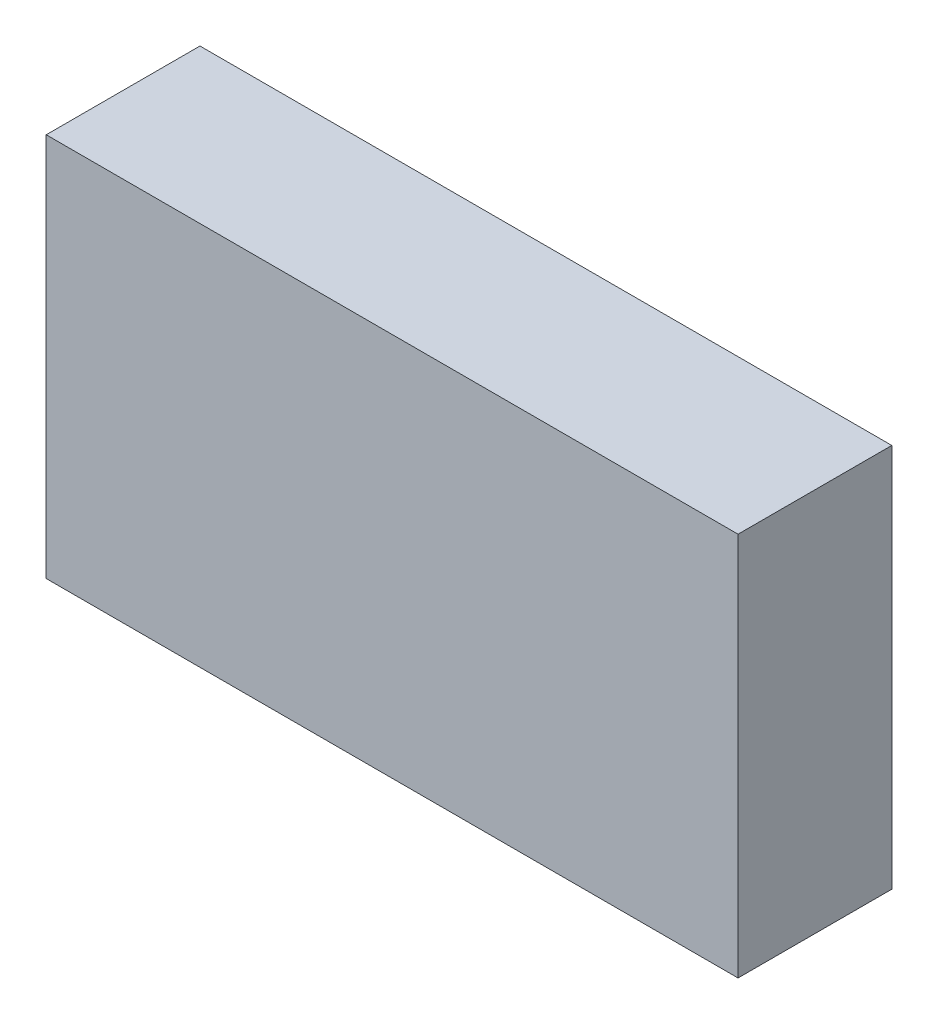
ISO-10303-21;
HEADER;
FILE_DESCRIPTION(('STEP AP214'),'2;1');
FILE_NAME('part.step','',(''),(''),'','','');
FILE_SCHEMA(('AUTOMOTIVE_DESIGN { 1 0 10303 214 1 1 1 1 }'));
ENDSEC;
DATA;
#1=APPLICATION_CONTEXT('core data for automotive mechanical design processes');
#2=APPLICATION_PROTOCOL_DEFINITION('international standard','automotive_design',2000,#1);
#3=PRODUCT_CONTEXT('',#1,'mechanical');
#4=PRODUCT('Part','Part','',(#3));
#5=PRODUCT_RELATED_PRODUCT_CATEGORY('part','',(#4));
#6=PRODUCT_DEFINITION_FORMATION('','',#4);
#7=PRODUCT_DEFINITION_CONTEXT('part definition',#1,'design');
#8=PRODUCT_DEFINITION('design','',#6,#7);
#9=PRODUCT_DEFINITION_SHAPE('','',#8);
#10=(LENGTH_UNIT() NAMED_UNIT(*) SI_UNIT(.MILLI.,.METRE.));
#11=(NAMED_UNIT(*) PLANE_ANGLE_UNIT() SI_UNIT($,.RADIAN.));
#12=(NAMED_UNIT(*) SI_UNIT($,.STERADIAN.) SOLID_ANGLE_UNIT());
#13=UNCERTAINTY_MEASURE_WITH_UNIT(LENGTH_MEASURE(1.E-05),#10,'distance_accuracy_value','');
#14=(GEOMETRIC_REPRESENTATION_CONTEXT(3) GLOBAL_UNCERTAINTY_ASSIGNED_CONTEXT((#13)) GLOBAL_UNIT_ASSIGNED_CONTEXT((#10,
#11,#12)) REPRESENTATION_CONTEXT('',''));
#15=CARTESIAN_POINT('',(0.,0.,0.));
#16=DIRECTION('',(0.,0.,1.));
#17=DIRECTION('',(1.,0.,0.));
#18=AXIS2_PLACEMENT_3D('',#15,#16,#17);
#19=CARTESIAN_POINT('',(1.6,0.875,0.));
#20=DIRECTION('',(1.,0.,0.));
#21=DIRECTION('',(0.,0.,1.));
#22=AXIS2_PLACEMENT_3D('',#19,#20,#21);
#23=PLANE('',#22);
#24=DIRECTION('',(0.,1.,0.));
#25=VECTOR('',#24,1.);
#26=CARTESIAN_POINT('',(1.6,0.875,0.1));
#27=LINE('',#26,#25);
#28=CARTESIAN_POINT('',(1.6,0.875,0.1));
#29=VERTEX_POINT('',#28);
#30=CARTESIAN_POINT('',(1.6,1.125,0.1));
#31=VERTEX_POINT('',#30);
#32=EDGE_CURVE('E11',#29,#31,#27,.T.);
#33=ORIENTED_EDGE('',*,*,#32,.T.);
#34=DIRECTION('',(0.,0.,1.));
#35=VECTOR('',#34,1.);
#36=CARTESIAN_POINT('',(1.6,1.125,0.));
#37=LINE('',#36,#35);
#38=CARTESIAN_POINT('',(1.6,1.125,0.));
#39=VERTEX_POINT('',#38);
#40=EDGE_CURVE('E24',#39,#31,#37,.T.);
#41=ORIENTED_EDGE('',*,*,#40,.F.);
#42=DIRECTION('',(0.,1.,0.));
#43=VECTOR('',#42,1.);
#44=CARTESIAN_POINT('',(1.6,0.875,0.));
#45=LINE('',#44,#43);
#46=CARTESIAN_POINT('',(1.6,0.875,0.));
#47=VERTEX_POINT('',#46);
#48=EDGE_CURVE('E86',#47,#39,#45,.T.);
#49=ORIENTED_EDGE('',*,*,#48,.F.);
#50=DIRECTION('',(0.,0.,1.));
#51=VECTOR('',#50,1.);
#52=CARTESIAN_POINT('',(1.6,0.875,0.));
#53=LINE('',#52,#51);
#54=EDGE_CURVE('E36',#47,#29,#53,.T.);
#55=ORIENTED_EDGE('',*,*,#54,.T.);
#56=EDGE_LOOP('',(#33,#41,#49,#55));
#57=FACE_BOUND('',#56,.T.);
#58=ADVANCED_FACE('F17',(#57),#23,.F.);
#59=CARTESIAN_POINT('',(2.05,0.875,0.));
#60=DIRECTION('',(1.,0.,0.));
#61=DIRECTION('',(0.,0.,1.));
#62=AXIS2_PLACEMENT_3D('',#59,#60,#61);
#63=PLANE('',#62);
#64=DIRECTION('',(0.,0.,1.));
#65=VECTOR('',#64,1.);
#66=CARTESIAN_POINT('',(2.05,0.875,0.));
#67=LINE('',#66,#65);
#68=CARTESIAN_POINT('',(2.05,0.875,0.));
#69=VERTEX_POINT('',#68);
#70=CARTESIAN_POINT('',(2.05,0.875,0.1));
#71=VERTEX_POINT('',#70);
#72=EDGE_CURVE('E83',#69,#71,#67,.T.);
#73=ORIENTED_EDGE('',*,*,#72,.F.);
#74=DIRECTION('',(0.,1.,0.));
#75=VECTOR('',#74,1.);
#76=CARTESIAN_POINT('',(2.05,0.875,0.));
#77=LINE('',#76,#75);
#78=CARTESIAN_POINT('',(2.05,1.125,0.));
#79=VERTEX_POINT('',#78);
#80=EDGE_CURVE('E63',#69,#79,#77,.T.);
#81=ORIENTED_EDGE('',*,*,#80,.T.);
#82=DIRECTION('',(0.,0.,1.));
#83=VECTOR('',#82,1.);
#84=CARTESIAN_POINT('',(2.05,1.125,0.));
#85=LINE('',#84,#83);
#86=CARTESIAN_POINT('',(2.05,1.125,0.1));
#87=VERTEX_POINT('',#86);
#88=EDGE_CURVE('E57',#79,#87,#85,.T.);
#89=ORIENTED_EDGE('',*,*,#88,.T.);
#90=DIRECTION('',(0.,1.,0.));
#91=VECTOR('',#90,1.);
#92=CARTESIAN_POINT('',(2.05,0.875,0.1));
#93=LINE('',#92,#91);
#94=EDGE_CURVE('E60',#71,#87,#93,.T.);
#95=ORIENTED_EDGE('',*,*,#94,.F.);
#96=EDGE_LOOP('',(#73,#81,#89,#95));
#97=FACE_BOUND('',#96,.T.);
#98=ADVANCED_FACE('F59',(#97),#63,.T.);
#99=CARTESIAN_POINT('',(1.6,0.875,0.));
#100=DIRECTION('',(0.,1.,0.));
#101=DIRECTION('',(0.,0.,1.));
#102=AXIS2_PLACEMENT_3D('',#99,#100,#101);
#103=PLANE('',#102);
#104=ORIENTED_EDGE('',*,*,#72,.T.);
#105=DIRECTION('',(1.,0.,0.));
#106=VECTOR('',#105,1.);
#107=CARTESIAN_POINT('',(1.6,0.875,0.1));
#108=LINE('',#107,#106);
#109=EDGE_CURVE('E71',#29,#71,#108,.T.);
#110=ORIENTED_EDGE('',*,*,#109,.F.);
#111=ORIENTED_EDGE('',*,*,#54,.F.);
#112=DIRECTION('',(1.,0.,0.));
#113=VECTOR('',#112,1.);
#114=CARTESIAN_POINT('',(1.6,0.875,0.));
#115=LINE('',#114,#113);
#116=EDGE_CURVE('E76',#47,#69,#115,.T.);
#117=ORIENTED_EDGE('',*,*,#116,.T.);
#118=EDGE_LOOP('',(#104,#110,#111,#117));
#119=FACE_BOUND('',#118,.T.);
#120=ADVANCED_FACE('F91',(#119),#103,.F.);
#121=CARTESIAN_POINT('',(1.6,1.125,0.));
#122=DIRECTION('',(0.,1.,0.));
#123=DIRECTION('',(0.,0.,1.));
#124=AXIS2_PLACEMENT_3D('',#121,#122,#123);
#125=PLANE('',#124);
#126=DIRECTION('',(1.,0.,0.));
#127=VECTOR('',#126,1.);
#128=CARTESIAN_POINT('',(1.6,1.125,0.));
#129=LINE('',#128,#127);
#130=EDGE_CURVE('E74',#39,#79,#129,.T.);
#131=ORIENTED_EDGE('',*,*,#130,.F.);
#132=ORIENTED_EDGE('',*,*,#40,.T.);
#133=DIRECTION('',(1.,0.,0.));
#134=VECTOR('',#133,1.);
#135=CARTESIAN_POINT('',(1.6,1.125,0.1));
#136=LINE('',#135,#134);
#137=EDGE_CURVE('E69',#31,#87,#136,.T.);
#138=ORIENTED_EDGE('',*,*,#137,.T.);
#139=ORIENTED_EDGE('',*,*,#88,.F.);
#140=EDGE_LOOP('',(#131,#132,#138,#139));
#141=FACE_BOUND('',#140,.T.);
#142=ADVANCED_FACE('F73',(#141),#125,.T.);
#143=CARTESIAN_POINT('',(1.6,0.875,0.));
#144=DIRECTION('',(0.,0.,1.));
#145=DIRECTION('',(1.,0.,0.));
#146=AXIS2_PLACEMENT_3D('',#143,#144,#145);
#147=PLANE('',#146);
#148=ORIENTED_EDGE('',*,*,#130,.T.);
#149=ORIENTED_EDGE('',*,*,#80,.F.);
#150=ORIENTED_EDGE('',*,*,#116,.F.);
#151=ORIENTED_EDGE('',*,*,#48,.T.);
#152=EDGE_LOOP('',(#148,#149,#150,#151));
#153=FACE_BOUND('',#152,.T.);
#154=ADVANCED_FACE('F89',(#153),#147,.F.);
#155=CARTESIAN_POINT('',(1.6,0.875,0.1));
#156=DIRECTION('',(0.,0.,1.));
#157=DIRECTION('',(1.,0.,0.));
#158=AXIS2_PLACEMENT_3D('',#155,#156,#157);
#159=PLANE('',#158);
#160=ORIENTED_EDGE('',*,*,#32,.F.);
#161=ORIENTED_EDGE('',*,*,#109,.T.);
#162=ORIENTED_EDGE('',*,*,#94,.T.);
#163=ORIENTED_EDGE('',*,*,#137,.F.);
#164=EDGE_LOOP('',(#160,#161,#162,#163));
#165=FACE_BOUND('',#164,.T.);
#166=ADVANCED_FACE('F68',(#165),#159,.T.);
#167=CLOSED_SHELL('',(#58,#98,#120,#142,#154,#166));
#168=MANIFOLD_SOLID_BREP('B1',#167);
#169=ADVANCED_BREP_SHAPE_REPRESENTATION('',(#18,#168),#14);
#170=SHAPE_DEFINITION_REPRESENTATION(#9,#169);
ENDSEC;
END-ISO-10303-21;
